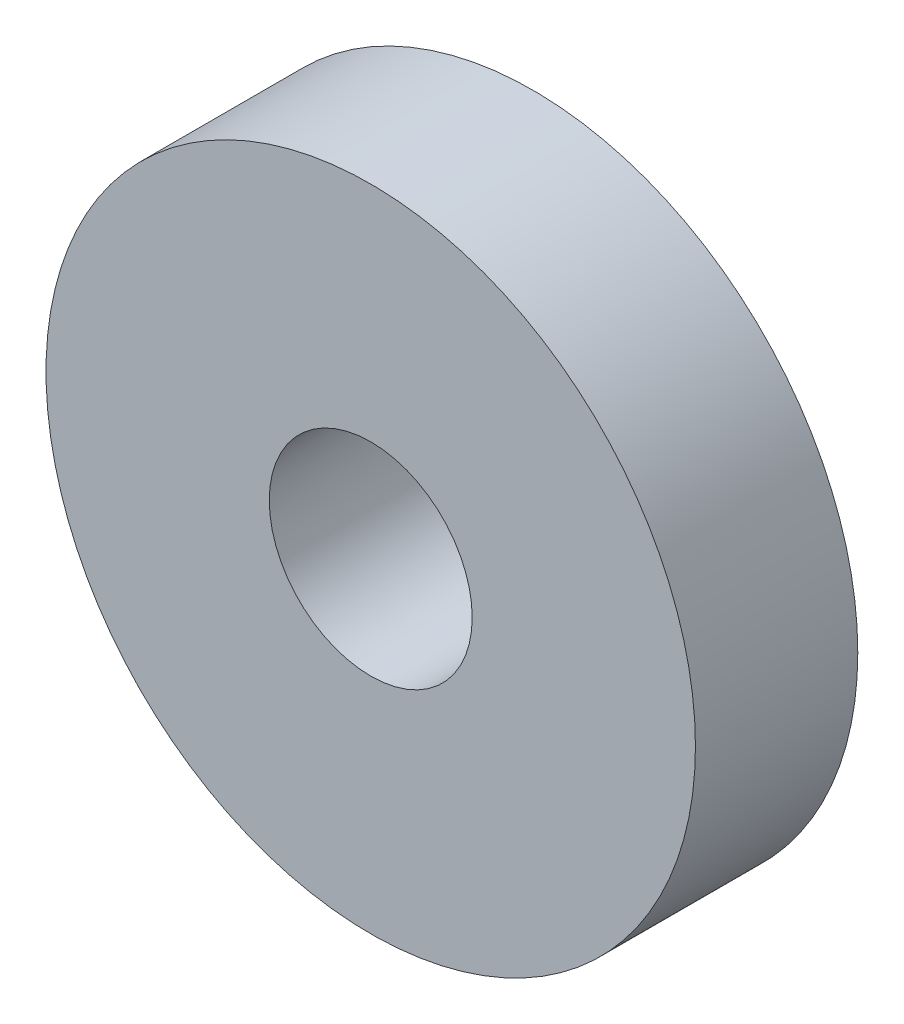
ISO-10303-21;
HEADER;
FILE_DESCRIPTION(('STEP AP214'),'2;1');
FILE_NAME('part.step','',(''),(''),'','','');
FILE_SCHEMA(('AUTOMOTIVE_DESIGN { 1 0 10303 214 1 1 1 1 }'));
ENDSEC;
DATA;
#1=APPLICATION_CONTEXT('core data for automotive mechanical design processes');
#2=APPLICATION_PROTOCOL_DEFINITION('international standard','automotive_design',2000,#1);
#3=PRODUCT_CONTEXT('',#1,'mechanical');
#4=PRODUCT('Part','Part','',(#3));
#5=PRODUCT_RELATED_PRODUCT_CATEGORY('part','',(#4));
#6=PRODUCT_DEFINITION_FORMATION('','',#4);
#7=PRODUCT_DEFINITION_CONTEXT('part definition',#1,'design');
#8=PRODUCT_DEFINITION('design','',#6,#7);
#9=PRODUCT_DEFINITION_SHAPE('','',#8);
#10=(LENGTH_UNIT() NAMED_UNIT(*) SI_UNIT(.MILLI.,.METRE.));
#11=(NAMED_UNIT(*) PLANE_ANGLE_UNIT() SI_UNIT($,.RADIAN.));
#12=(NAMED_UNIT(*) SI_UNIT($,.STERADIAN.) SOLID_ANGLE_UNIT());
#13=UNCERTAINTY_MEASURE_WITH_UNIT(LENGTH_MEASURE(1.E-05),#10,'distance_accuracy_value','');
#14=(GEOMETRIC_REPRESENTATION_CONTEXT(3) GLOBAL_UNCERTAINTY_ASSIGNED_CONTEXT((#13)) GLOBAL_UNIT_ASSIGNED_CONTEXT((#10,
#11,#12)) REPRESENTATION_CONTEXT('',''));
#15=CARTESIAN_POINT('',(0.,0.,0.));
#16=DIRECTION('',(0.,0.,1.));
#17=DIRECTION('',(1.,0.,0.));
#18=AXIS2_PLACEMENT_3D('',#15,#16,#17);
#19=CARTESIAN_POINT('',(0.,0.,2.));
#20=DIRECTION('',(0.,0.,1.));
#21=DIRECTION('',(1.,0.,0.));
#22=AXIS2_PLACEMENT_3D('',#19,#20,#21);
#23=PLANE('',#22);
#24=CARTESIAN_POINT('',(0.,0.,2.));
#25=DIRECTION('',(0.,0.,1.));
#26=DIRECTION('',(1.,0.,0.));
#27=AXIS2_PLACEMENT_3D('',#24,#25,#26);
#28=CIRCLE('',#27,4.);
#29=CARTESIAN_POINT('',(4.,0.,2.));
#30=VERTEX_POINT('',#29);
#31=EDGE_CURVE('E10',#30,#30,#28,.T.);
#32=ORIENTED_EDGE('',*,*,#31,.T.);
#33=EDGE_LOOP('',(#32));
#34=FACE_BOUND('',#33,.T.);
#35=CARTESIAN_POINT('',(0.,0.,2.));
#36=DIRECTION('',(0.,0.,1.));
#37=DIRECTION('',(1.,0.,0.));
#38=AXIS2_PLACEMENT_3D('',#35,#36,#37);
#39=CIRCLE('',#38,1.25);
#40=CARTESIAN_POINT('',(1.25,0.,2.));
#41=VERTEX_POINT('',#40);
#42=EDGE_CURVE('E40',#41,#41,#39,.T.);
#43=ORIENTED_EDGE('',*,*,#42,.F.);
#44=EDGE_LOOP('',(#43));
#45=FACE_BOUND('',#44,.T.);
#46=ADVANCED_FACE('F29',(#34,#45),#23,.T.);
#47=CARTESIAN_POINT('',(0.,0.,0.));
#48=DIRECTION('',(0.,0.,1.));
#49=DIRECTION('',(1.,0.,0.));
#50=AXIS2_PLACEMENT_3D('',#47,#48,#49);
#51=PLANE('',#50);
#52=CARTESIAN_POINT('',(0.,0.,0.));
#53=DIRECTION('',(0.,0.,1.));
#54=DIRECTION('',(1.,0.,0.));
#55=AXIS2_PLACEMENT_3D('',#52,#53,#54);
#56=CIRCLE('',#55,4.);
#57=CARTESIAN_POINT('',(4.,0.,0.));
#58=VERTEX_POINT('',#57);
#59=EDGE_CURVE('E36',#58,#58,#56,.T.);
#60=ORIENTED_EDGE('',*,*,#59,.F.);
#61=EDGE_LOOP('',(#60));
#62=FACE_BOUND('',#61,.T.);
#63=CARTESIAN_POINT('',(0.,0.,0.));
#64=DIRECTION('',(0.,0.,1.));
#65=DIRECTION('',(1.,0.,0.));
#66=AXIS2_PLACEMENT_3D('',#63,#64,#65);
#67=CIRCLE('',#66,1.25);
#68=CARTESIAN_POINT('',(1.25,0.,0.));
#69=VERTEX_POINT('',#68);
#70=EDGE_CURVE('E44',#69,#69,#67,.T.);
#71=ORIENTED_EDGE('',*,*,#70,.T.);
#72=EDGE_LOOP('',(#71));
#73=FACE_BOUND('',#72,.T.);
#74=ADVANCED_FACE('F50',(#62,#73),#51,.F.);
#75=CARTESIAN_POINT('',(0.,0.,2.));
#76=DIRECTION('',(0.,0.,-1.));
#77=DIRECTION('',(-1.,0.,0.));
#78=AXIS2_PLACEMENT_3D('',#75,#76,#77);
#79=CYLINDRICAL_SURFACE('',#78,4.);
#80=ORIENTED_EDGE('',*,*,#31,.F.);
#81=EDGE_LOOP('',(#80));
#82=FACE_BOUND('',#81,.T.);
#83=ORIENTED_EDGE('',*,*,#59,.T.);
#84=EDGE_LOOP('',(#83));
#85=FACE_BOUND('',#84,.T.);
#86=ADVANCED_FACE('F31',(#82,#85),#79,.T.);
#87=CARTESIAN_POINT('',(0.,0.,2.));
#88=DIRECTION('',(0.,0.,-1.));
#89=DIRECTION('',(-1.,0.,0.));
#90=AXIS2_PLACEMENT_3D('',#87,#88,#89);
#91=CYLINDRICAL_SURFACE('',#90,1.25);
#92=ORIENTED_EDGE('',*,*,#42,.T.);
#93=EDGE_LOOP('',(#92));
#94=FACE_BOUND('',#93,.T.);
#95=ORIENTED_EDGE('',*,*,#70,.F.);
#96=EDGE_LOOP('',(#95));
#97=FACE_BOUND('',#96,.T.);
#98=ADVANCED_FACE('F52',(#94,#97),#91,.F.);
#99=CLOSED_SHELL('',(#46,#74,#86,#98));
#100=MANIFOLD_SOLID_BREP('B2',#99);
#101=ADVANCED_BREP_SHAPE_REPRESENTATION('',(#18,#100),#14);
#102=SHAPE_DEFINITION_REPRESENTATION(#9,#101);
ENDSEC;
END-ISO-10303-21;
